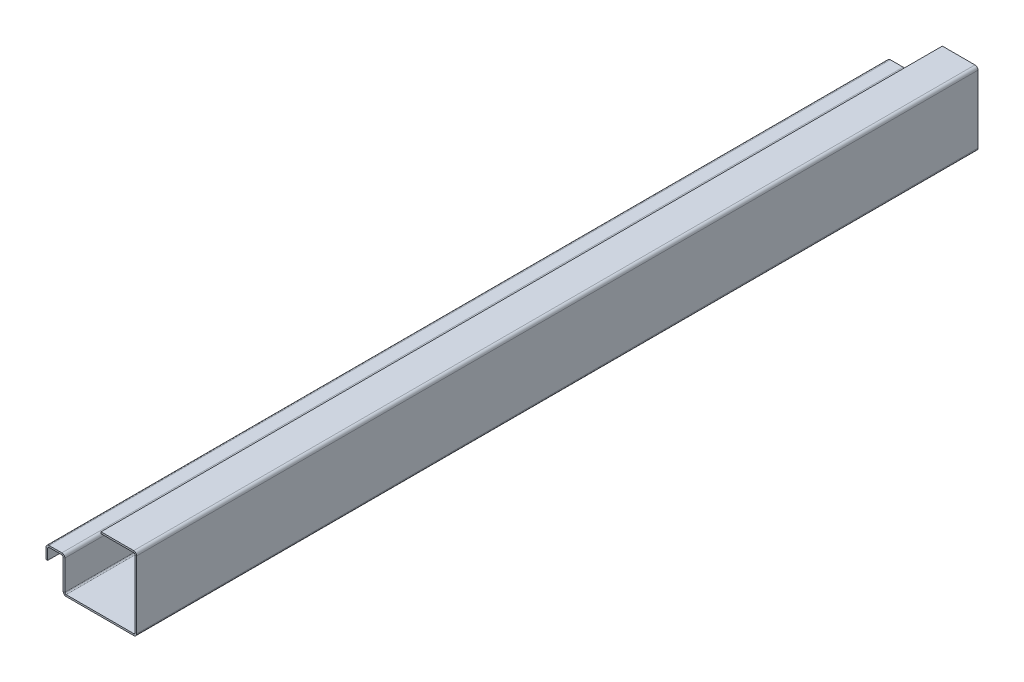
ISO-10303-21;
HEADER;
FILE_DESCRIPTION(('STEP AP214'),'2;1');
FILE_NAME('part.step','',(''),(''),'','','');
FILE_SCHEMA(('AUTOMOTIVE_DESIGN { 1 0 10303 214 1 1 1 1 }'));
ENDSEC;
DATA;
#1=APPLICATION_CONTEXT('core data for automotive mechanical design processes');
#2=APPLICATION_PROTOCOL_DEFINITION('international standard','automotive_design',2000,#1);
#3=PRODUCT_CONTEXT('',#1,'mechanical');
#4=PRODUCT('Part','Part','',(#3));
#5=PRODUCT_RELATED_PRODUCT_CATEGORY('part','',(#4));
#6=PRODUCT_DEFINITION_FORMATION('','',#4);
#7=PRODUCT_DEFINITION_CONTEXT('part definition',#1,'design');
#8=PRODUCT_DEFINITION('design','',#6,#7);
#9=PRODUCT_DEFINITION_SHAPE('','',#8);
#10=(LENGTH_UNIT() NAMED_UNIT(*) SI_UNIT(.MILLI.,.METRE.));
#11=(NAMED_UNIT(*) PLANE_ANGLE_UNIT() SI_UNIT($,.RADIAN.));
#12=(NAMED_UNIT(*) SI_UNIT($,.STERADIAN.) SOLID_ANGLE_UNIT());
#13=UNCERTAINTY_MEASURE_WITH_UNIT(LENGTH_MEASURE(1.E-05),#10,'distance_accuracy_value','');
#14=(GEOMETRIC_REPRESENTATION_CONTEXT(3) GLOBAL_UNCERTAINTY_ASSIGNED_CONTEXT((#13)) GLOBAL_UNIT_ASSIGNED_CONTEXT((#10,
#11,#12)) REPRESENTATION_CONTEXT('',''));
#15=CARTESIAN_POINT('',(0.,0.,0.));
#16=DIRECTION('',(0.,0.,1.));
#17=DIRECTION('',(1.,0.,0.));
#18=AXIS2_PLACEMENT_3D('',#15,#16,#17);
#19=CARTESIAN_POINT('',(-60.5,40.4,500.));
#20=DIRECTION('',(0.,0.,1.));
#21=DIRECTION('',(1.,0.,0.));
#22=AXIS2_PLACEMENT_3D('',#19,#20,#21);
#23=PLANE('',#22);
#24=DIRECTION('',(0.,-1.,0.));
#25=VECTOR('',#24,1.);
#26=CARTESIAN_POINT('',(-60.5,40.4,500.));
#27=LINE('',#26,#25);
#28=CARTESIAN_POINT('',(-60.5,40.4,500.));
#29=VERTEX_POINT('',#28);
#30=CARTESIAN_POINT('',(-60.5,38.4,500.));
#31=VERTEX_POINT('',#30);
#32=EDGE_CURVE('E11',#29,#31,#27,.T.);
#33=ORIENTED_EDGE('',*,*,#32,.F.);
#34=CARTESIAN_POINT('',(-60.5,36.8,500.));
#35=DIRECTION('',(0.,0.,1.));
#36=DIRECTION('',(1.,0.,0.));
#37=AXIS2_PLACEMENT_3D('',#34,#35,#36);
#38=CIRCLE('',#37,3.6);
#39=CARTESIAN_POINT('',(-64.1,36.8,500.));
#40=VERTEX_POINT('',#39);
#41=EDGE_CURVE('E422',#40,#29,#38,.F.);
#42=ORIENTED_EDGE('',*,*,#41,.F.);
#43=DIRECTION('',(-1.,0.,0.));
#44=VECTOR('',#43,1.);
#45=CARTESIAN_POINT('',(-62.1,36.8,500.));
#46=LINE('',#45,#44);
#47=CARTESIAN_POINT('',(-62.1,36.8,500.));
#48=VERTEX_POINT('',#47);
#49=EDGE_CURVE('E45',#48,#40,#46,.T.);
#50=ORIENTED_EDGE('',*,*,#49,.F.);
#51=CARTESIAN_POINT('',(-60.5,36.8,500.));
#52=DIRECTION('',(0.,0.,1.));
#53=DIRECTION('',(1.,0.,0.));
#54=AXIS2_PLACEMENT_3D('',#51,#52,#53);
#55=CIRCLE('',#54,1.6);
#56=EDGE_CURVE('E435',#48,#31,#55,.F.);
#57=ORIENTED_EDGE('',*,*,#56,.T.);
#58=EDGE_LOOP('',(#33,#42,#50,#57));
#59=FACE_BOUND('',#58,.T.);
#60=ADVANCED_FACE('F37',(#59),#23,.T.);
#61=CARTESIAN_POINT('',(-62.1,36.8,500.));
#62=DIRECTION('',(0.,0.,1.));
#63=DIRECTION('',(1.,0.,0.));
#64=AXIS2_PLACEMENT_3D('',#61,#62,#63);
#65=PLANE('',#64);
#66=DIRECTION('',(1.,0.,0.));
#67=VECTOR('',#66,1.);
#68=CARTESIAN_POINT('',(-64.1,40.4,500.));
#69=LINE('',#68,#67);
#70=CARTESIAN_POINT('',(-45.3,40.4,500.));
#71=VERTEX_POINT('',#70);
#72=EDGE_CURVE('E426',#29,#71,#69,.T.);
#73=ORIENTED_EDGE('',*,*,#72,.F.);
#74=ORIENTED_EDGE('',*,*,#32,.T.);
#75=DIRECTION('',(1.,0.,0.));
#76=VECTOR('',#75,1.);
#77=CARTESIAN_POINT('',(-64.1,38.4,500.));
#78=LINE('',#77,#76);
#79=CARTESIAN_POINT('',(-45.3,38.4,500.));
#80=VERTEX_POINT('',#79);
#81=EDGE_CURVE('E437',#31,#80,#78,.T.);
#82=ORIENTED_EDGE('',*,*,#81,.T.);
#83=DIRECTION('',(0.,1.,0.));
#84=VECTOR('',#83,1.);
#85=CARTESIAN_POINT('',(-45.3,38.4,500.));
#86=LINE('',#85,#84);
#87=EDGE_CURVE('E396',#80,#71,#86,.T.);
#88=ORIENTED_EDGE('',*,*,#87,.T.);
#89=EDGE_LOOP('',(#73,#74,#82,#88));
#90=FACE_BOUND('',#89,.T.);
#91=ADVANCED_FACE('F518',(#90),#65,.T.);
#92=CARTESIAN_POINT('',(-64.1,36.8,-500.));
#93=DIRECTION('',(0.,0.,-1.));
#94=DIRECTION('',(-1.,0.,0.));
#95=AXIS2_PLACEMENT_3D('',#92,#93,#94);
#96=PLANE('',#95);
#97=DIRECTION('',(1.,0.,0.));
#98=VECTOR('',#97,1.);
#99=CARTESIAN_POINT('',(-64.1,36.8,-500.));
#100=LINE('',#99,#98);
#101=CARTESIAN_POINT('',(-64.1,36.8,-500.));
#102=VERTEX_POINT('',#101);
#103=CARTESIAN_POINT('',(-62.1,36.8,-500.));
#104=VERTEX_POINT('',#103);
#105=EDGE_CURVE('E402',#102,#104,#100,.T.);
#106=ORIENTED_EDGE('',*,*,#105,.F.);
#107=CARTESIAN_POINT('',(-60.5,36.8,-500.));
#108=DIRECTION('',(0.,0.,1.));
#109=DIRECTION('',(1.,0.,0.));
#110=AXIS2_PLACEMENT_3D('',#107,#108,#109);
#111=CIRCLE('',#110,3.6);
#112=CARTESIAN_POINT('',(-60.5,40.4,-500.));
#113=VERTEX_POINT('',#112);
#114=EDGE_CURVE('E280',#102,#113,#111,.F.);
#115=ORIENTED_EDGE('',*,*,#114,.T.);
#116=DIRECTION('',(0.,1.,0.));
#117=VECTOR('',#116,1.);
#118=CARTESIAN_POINT('',(-60.5,38.4,-500.));
#119=LINE('',#118,#117);
#120=CARTESIAN_POINT('',(-60.5,38.4,-500.));
#121=VERTEX_POINT('',#120);
#122=EDGE_CURVE('E400',#121,#113,#119,.T.);
#123=ORIENTED_EDGE('',*,*,#122,.F.);
#124=CARTESIAN_POINT('',(-60.5,36.8,-500.));
#125=DIRECTION('',(0.,0.,1.));
#126=DIRECTION('',(1.,0.,0.));
#127=AXIS2_PLACEMENT_3D('',#124,#125,#126);
#128=CIRCLE('',#127,1.6);
#129=EDGE_CURVE('E292',#104,#121,#128,.F.);
#130=ORIENTED_EDGE('',*,*,#129,.F.);
#131=EDGE_LOOP('',(#106,#115,#123,#130));
#132=FACE_BOUND('',#131,.T.);
#133=ADVANCED_FACE('F577',(#132),#96,.T.);
#134=CARTESIAN_POINT('',(-60.5,38.4,-500.));
#135=DIRECTION('',(0.,0.,-1.));
#136=DIRECTION('',(-1.,0.,0.));
#137=AXIS2_PLACEMENT_3D('',#134,#135,#136);
#138=PLANE('',#137);
#139=DIRECTION('',(0.,1.,0.));
#140=VECTOR('',#139,1.);
#141=CARTESIAN_POINT('',(-64.1,24.2,-500.));
#142=LINE('',#141,#140);
#143=CARTESIAN_POINT('',(-64.1,24.2,-500.));
#144=VERTEX_POINT('',#143);
#145=EDGE_CURVE('E283',#144,#102,#142,.T.);
#146=ORIENTED_EDGE('',*,*,#145,.T.);
#147=ORIENTED_EDGE('',*,*,#105,.T.);
#148=DIRECTION('',(0.,1.,0.));
#149=VECTOR('',#148,1.);
#150=CARTESIAN_POINT('',(-62.1,24.2,-500.));
#151=LINE('',#150,#149);
#152=CARTESIAN_POINT('',(-62.1,24.2,-500.));
#153=VERTEX_POINT('',#152);
#154=EDGE_CURVE('E289',#153,#104,#151,.T.);
#155=ORIENTED_EDGE('',*,*,#154,.F.);
#156=DIRECTION('',(-1.,0.,0.));
#157=VECTOR('',#156,1.);
#158=CARTESIAN_POINT('',(-62.1,24.2,-500.));
#159=LINE('',#158,#157);
#160=EDGE_CURVE('E286',#153,#144,#159,.T.);
#161=ORIENTED_EDGE('',*,*,#160,.T.);
#162=EDGE_LOOP('',(#146,#147,#155,#161));
#163=FACE_BOUND('',#162,.T.);
#164=ADVANCED_FACE('F581',(#163),#138,.T.);
#165=CARTESIAN_POINT('',(-41.7,36.8,500.));
#166=DIRECTION('',(0.,0.,1.));
#167=DIRECTION('',(1.,0.,0.));
#168=AXIS2_PLACEMENT_3D('',#165,#166,#167);
#169=PLANE('',#168);
#170=DIRECTION('',(-1.,0.,0.));
#171=VECTOR('',#170,1.);
#172=CARTESIAN_POINT('',(-41.7,36.8,500.));
#173=LINE('',#172,#171);
#174=CARTESIAN_POINT('',(-41.7,36.8,500.));
#175=VERTEX_POINT('',#174);
#176=CARTESIAN_POINT('',(-43.7,36.8,500.));
#177=VERTEX_POINT('',#176);
#178=EDGE_CURVE('E398',#175,#177,#173,.T.);
#179=ORIENTED_EDGE('',*,*,#178,.F.);
#180=CARTESIAN_POINT('',(-45.3,36.8,500.));
#181=DIRECTION('',(0.,0.,1.));
#182=DIRECTION('',(1.,0.,0.));
#183=AXIS2_PLACEMENT_3D('',#180,#181,#182);
#184=CIRCLE('',#183,3.6);
#185=EDGE_CURVE('E508',#71,#175,#184,.F.);
#186=ORIENTED_EDGE('',*,*,#185,.F.);
#187=ORIENTED_EDGE('',*,*,#87,.F.);
#188=CARTESIAN_POINT('',(-45.3,36.8,500.));
#189=DIRECTION('',(0.,0.,1.));
#190=DIRECTION('',(1.,0.,0.));
#191=AXIS2_PLACEMENT_3D('',#188,#189,#190);
#192=CIRCLE('',#191,1.6);
#193=EDGE_CURVE('E440',#80,#177,#192,.F.);
#194=ORIENTED_EDGE('',*,*,#193,.T.);
#195=EDGE_LOOP('',(#179,#186,#187,#194));
#196=FACE_BOUND('',#195,.T.);
#197=ADVANCED_FACE('F525',(#196),#169,.T.);
#198=CARTESIAN_POINT('',(-45.3,38.4,500.));
#199=DIRECTION('',(0.,0.,1.));
#200=DIRECTION('',(1.,0.,0.));
#201=AXIS2_PLACEMENT_3D('',#198,#199,#200);
#202=PLANE('',#201);
#203=DIRECTION('',(0.,-1.,0.));
#204=VECTOR('',#203,1.);
#205=CARTESIAN_POINT('',(-41.7,40.4,500.));
#206=LINE('',#205,#204);
#207=CARTESIAN_POINT('',(-41.7,1.6,500.));
#208=VERTEX_POINT('',#207);
#209=EDGE_CURVE('E505',#175,#208,#206,.T.);
#210=ORIENTED_EDGE('',*,*,#209,.F.);
#211=ORIENTED_EDGE('',*,*,#178,.T.);
#212=DIRECTION('',(0.,1.,0.));
#213=VECTOR('',#212,1.);
#214=CARTESIAN_POINT('',(-43.7,40.4,500.));
#215=LINE('',#214,#213);
#216=CARTESIAN_POINT('',(-43.7,1.6,500.));
#217=VERTEX_POINT('',#216);
#218=EDGE_CURVE('E443',#177,#217,#215,.F.);
#219=ORIENTED_EDGE('',*,*,#218,.T.);
#220=DIRECTION('',(1.,0.,0.));
#221=VECTOR('',#220,1.);
#222=CARTESIAN_POINT('',(-43.7,1.6,500.));
#223=LINE('',#222,#221);
#224=EDGE_CURVE('E388',#217,#208,#223,.T.);
#225=ORIENTED_EDGE('',*,*,#224,.T.);
#226=EDGE_LOOP('',(#210,#211,#219,#225));
#227=FACE_BOUND('',#226,.T.);
#228=ADVANCED_FACE('F534',(#227),#202,.T.);
#229=CARTESIAN_POINT('',(-45.3,40.4,-500.));
#230=DIRECTION('',(0.,0.,-1.));
#231=DIRECTION('',(-1.,0.,0.));
#232=AXIS2_PLACEMENT_3D('',#229,#230,#231);
#233=PLANE('',#232);
#234=DIRECTION('',(0.,-1.,0.));
#235=VECTOR('',#234,1.);
#236=CARTESIAN_POINT('',(-45.3,40.4,-500.));
#237=LINE('',#236,#235);
#238=CARTESIAN_POINT('',(-45.3,40.4,-500.));
#239=VERTEX_POINT('',#238);
#240=CARTESIAN_POINT('',(-45.3,38.4,-500.));
#241=VERTEX_POINT('',#240);
#242=EDGE_CURVE('E394',#239,#241,#237,.T.);
#243=ORIENTED_EDGE('',*,*,#242,.F.);
#244=CARTESIAN_POINT('',(-45.3,36.8,-500.));
#245=DIRECTION('',(0.,0.,1.));
#246=DIRECTION('',(1.,0.,0.));
#247=AXIS2_PLACEMENT_3D('',#244,#245,#246);
#248=CIRCLE('',#247,3.6);
#249=CARTESIAN_POINT('',(-41.7,36.8,-500.));
#250=VERTEX_POINT('',#249);
#251=EDGE_CURVE('E274',#239,#250,#248,.F.);
#252=ORIENTED_EDGE('',*,*,#251,.T.);
#253=DIRECTION('',(1.,0.,0.));
#254=VECTOR('',#253,1.);
#255=CARTESIAN_POINT('',(-43.7,36.8,-500.));
#256=LINE('',#255,#254);
#257=CARTESIAN_POINT('',(-43.7,36.8,-500.));
#258=VERTEX_POINT('',#257);
#259=EDGE_CURVE('E392',#258,#250,#256,.T.);
#260=ORIENTED_EDGE('',*,*,#259,.F.);
#261=CARTESIAN_POINT('',(-45.3,36.8,-500.));
#262=DIRECTION('',(0.,0.,1.));
#263=DIRECTION('',(1.,0.,0.));
#264=AXIS2_PLACEMENT_3D('',#261,#262,#263);
#265=CIRCLE('',#264,1.6);
#266=EDGE_CURVE('E298',#241,#258,#265,.F.);
#267=ORIENTED_EDGE('',*,*,#266,.F.);
#268=EDGE_LOOP('',(#243,#252,#260,#267));
#269=FACE_BOUND('',#268,.T.);
#270=ADVANCED_FACE('F592',(#269),#233,.T.);
#271=CARTESIAN_POINT('',(-43.7,36.8,-500.));
#272=DIRECTION('',(0.,0.,-1.));
#273=DIRECTION('',(-1.,0.,0.));
#274=AXIS2_PLACEMENT_3D('',#271,#272,#273);
#275=PLANE('',#274);
#276=DIRECTION('',(1.,0.,0.));
#277=VECTOR('',#276,1.);
#278=CARTESIAN_POINT('',(-64.1,40.4,-500.));
#279=LINE('',#278,#277);
#280=EDGE_CURVE('E277',#113,#239,#279,.T.);
#281=ORIENTED_EDGE('',*,*,#280,.T.);
#282=ORIENTED_EDGE('',*,*,#242,.T.);
#283=DIRECTION('',(1.,0.,0.));
#284=VECTOR('',#283,1.);
#285=CARTESIAN_POINT('',(-64.1,38.4,-500.));
#286=LINE('',#285,#284);
#287=EDGE_CURVE('E295',#121,#241,#286,.T.);
#288=ORIENTED_EDGE('',*,*,#287,.F.);
#289=ORIENTED_EDGE('',*,*,#122,.T.);
#290=EDGE_LOOP('',(#281,#282,#288,#289));
#291=FACE_BOUND('',#290,.T.);
#292=ADVANCED_FACE('F595',(#291),#275,.T.);
#293=CARTESIAN_POINT('',(-40.1,0.,500.));
#294=DIRECTION('',(0.,0.,1.));
#295=DIRECTION('',(1.,0.,0.));
#296=AXIS2_PLACEMENT_3D('',#293,#294,#295);
#297=PLANE('',#296);
#298=DIRECTION('',(0.,-1.,0.));
#299=VECTOR('',#298,1.);
#300=CARTESIAN_POINT('',(-40.1,0.,500.));
#301=LINE('',#300,#299);
#302=CARTESIAN_POINT('',(-40.1,0.,500.));
#303=VERTEX_POINT('',#302);
#304=CARTESIAN_POINT('',(-40.1,-2.,500.));
#305=VERTEX_POINT('',#304);
#306=EDGE_CURVE('E390',#303,#305,#301,.T.);
#307=ORIENTED_EDGE('',*,*,#306,.F.);
#308=CARTESIAN_POINT('',(-40.1,1.6,500.));
#309=DIRECTION('',(0.,0.,-1.));
#310=DIRECTION('',(-1.,0.,0.));
#311=AXIS2_PLACEMENT_3D('',#308,#309,#310);
#312=CIRCLE('',#311,1.6);
#313=EDGE_CURVE('E502',#208,#303,#312,.F.);
#314=ORIENTED_EDGE('',*,*,#313,.F.);
#315=ORIENTED_EDGE('',*,*,#224,.F.);
#316=CARTESIAN_POINT('',(-40.1,1.6,500.));
#317=DIRECTION('',(0.,0.,1.));
#318=DIRECTION('',(1.,0.,0.));
#319=AXIS2_PLACEMENT_3D('',#316,#317,#318);
#320=CIRCLE('',#319,3.6);
#321=EDGE_CURVE('E446',#217,#305,#320,.T.);
#322=ORIENTED_EDGE('',*,*,#321,.T.);
#323=EDGE_LOOP('',(#307,#314,#315,#322));
#324=FACE_BOUND('',#323,.T.);
#325=ADVANCED_FACE('F543',(#324),#297,.T.);
#326=CARTESIAN_POINT('',(-43.7,1.6,500.));
#327=DIRECTION('',(0.,0.,1.));
#328=DIRECTION('',(1.,0.,0.));
#329=AXIS2_PLACEMENT_3D('',#326,#327,#328);
#330=PLANE('',#329);
#331=DIRECTION('',(1.,0.,0.));
#332=VECTOR('',#331,1.);
#333=CARTESIAN_POINT('',(-41.7,0.,500.));
#334=LINE('',#333,#332);
#335=CARTESIAN_POINT('',(40.1,0.,500.));
#336=VERTEX_POINT('',#335);
#337=EDGE_CURVE('E499',#303,#336,#334,.T.);
#338=ORIENTED_EDGE('',*,*,#337,.F.);
#339=ORIENTED_EDGE('',*,*,#306,.T.);
#340=DIRECTION('',(1.,0.,0.));
#341=VECTOR('',#340,1.);
#342=CARTESIAN_POINT('',(-41.7,-2.,500.));
#343=LINE('',#342,#341);
#344=CARTESIAN_POINT('',(40.1,-1.99999999999998,500.));
#345=VERTEX_POINT('',#344);
#346=EDGE_CURVE('E228',#305,#345,#343,.T.);
#347=ORIENTED_EDGE('',*,*,#346,.T.);
#348=DIRECTION('',(0.,1.,0.));
#349=VECTOR('',#348,1.);
#350=CARTESIAN_POINT('',(40.1,-1.99999999999998,500.));
#351=LINE('',#350,#349);
#352=EDGE_CURVE('E219',#345,#336,#351,.T.);
#353=ORIENTED_EDGE('',*,*,#352,.T.);
#354=EDGE_LOOP('',(#338,#339,#347,#353));
#355=FACE_BOUND('',#354,.T.);
#356=ADVANCED_FACE('F452',(#355),#330,.T.);
#357=CARTESIAN_POINT('',(-41.7,1.6,-500.));
#358=DIRECTION('',(0.,0.,-1.));
#359=DIRECTION('',(-1.,0.,0.));
#360=AXIS2_PLACEMENT_3D('',#357,#358,#359);
#361=PLANE('',#360);
#362=DIRECTION('',(-1.,0.,0.));
#363=VECTOR('',#362,1.);
#364=CARTESIAN_POINT('',(-41.7,1.6,-500.));
#365=LINE('',#364,#363);
#366=CARTESIAN_POINT('',(-41.7,1.6,-500.));
#367=VERTEX_POINT('',#366);
#368=CARTESIAN_POINT('',(-43.7,1.6,-500.));
#369=VERTEX_POINT('',#368);
#370=EDGE_CURVE('E386',#367,#369,#365,.T.);
#371=ORIENTED_EDGE('',*,*,#370,.F.);
#372=CARTESIAN_POINT('',(-40.1,1.6,-500.));
#373=DIRECTION('',(0.,0.,-1.));
#374=DIRECTION('',(-1.,0.,0.));
#375=AXIS2_PLACEMENT_3D('',#372,#373,#374);
#376=CIRCLE('',#375,1.6);
#377=CARTESIAN_POINT('',(-40.1,0.,-500.));
#378=VERTEX_POINT('',#377);
#379=EDGE_CURVE('E268',#367,#378,#376,.F.);
#380=ORIENTED_EDGE('',*,*,#379,.T.);
#381=DIRECTION('',(0.,1.,0.));
#382=VECTOR('',#381,1.);
#383=CARTESIAN_POINT('',(-40.1,-2.,-500.));
#384=LINE('',#383,#382);
#385=CARTESIAN_POINT('',(-40.1,-2.,-500.));
#386=VERTEX_POINT('',#385);
#387=EDGE_CURVE('E218',#386,#378,#384,.T.);
#388=ORIENTED_EDGE('',*,*,#387,.F.);
#389=CARTESIAN_POINT('',(-40.1,1.6,-500.));
#390=DIRECTION('',(0.,0.,1.));
#391=DIRECTION('',(1.,0.,0.));
#392=AXIS2_PLACEMENT_3D('',#389,#390,#391);
#393=CIRCLE('',#392,3.6);
#394=EDGE_CURVE('E304',#369,#386,#393,.T.);
#395=ORIENTED_EDGE('',*,*,#394,.F.);
#396=EDGE_LOOP('',(#371,#380,#388,#395));
#397=FACE_BOUND('',#396,.T.);
#398=ADVANCED_FACE('F552',(#397),#361,.T.);
#399=CARTESIAN_POINT('',(-40.1,-2.,-500.));
#400=DIRECTION('',(0.,0.,-1.));
#401=DIRECTION('',(-1.,0.,0.));
#402=AXIS2_PLACEMENT_3D('',#399,#400,#401);
#403=PLANE('',#402);
#404=DIRECTION('',(0.,-1.,0.));
#405=VECTOR('',#404,1.);
#406=CARTESIAN_POINT('',(-41.7,40.4,-500.));
#407=LINE('',#406,#405);
#408=EDGE_CURVE('E271',#250,#367,#407,.T.);
#409=ORIENTED_EDGE('',*,*,#408,.T.);
#410=ORIENTED_EDGE('',*,*,#370,.T.);
#411=DIRECTION('',(0.,1.,0.));
#412=VECTOR('',#411,1.);
#413=CARTESIAN_POINT('',(-43.7,40.4,-500.));
#414=LINE('',#413,#412);
#415=EDGE_CURVE('E301',#258,#369,#414,.F.);
#416=ORIENTED_EDGE('',*,*,#415,.F.);
#417=ORIENTED_EDGE('',*,*,#259,.T.);
#418=EDGE_LOOP('',(#409,#410,#416,#417));
#419=FACE_BOUND('',#418,.T.);
#420=ADVANCED_FACE('F556',(#419),#403,.T.);
#421=CARTESIAN_POINT('',(41.7,1.60000000000001,500.));
#422=DIRECTION('',(0.,0.,1.));
#423=DIRECTION('',(1.,0.,0.));
#424=AXIS2_PLACEMENT_3D('',#421,#422,#423);
#425=PLANE('',#424);
#426=DIRECTION('',(1.,0.,0.));
#427=VECTOR('',#426,1.);
#428=CARTESIAN_POINT('',(41.7,1.60000000000001,500.));
#429=LINE('',#428,#427);
#430=CARTESIAN_POINT('',(41.7,1.60000000000001,500.));
#431=VERTEX_POINT('',#430);
#432=CARTESIAN_POINT('',(43.7,1.60000000000001,500.));
#433=VERTEX_POINT('',#432);
#434=EDGE_CURVE('E206',#431,#433,#429,.T.);
#435=ORIENTED_EDGE('',*,*,#434,.F.);
#436=CARTESIAN_POINT('',(40.1,1.60000000000001,500.));
#437=DIRECTION('',(0.,0.,-1.));
#438=DIRECTION('',(-1.,0.,0.));
#439=AXIS2_PLACEMENT_3D('',#436,#437,#438);
#440=CIRCLE('',#439,1.6);
#441=EDGE_CURVE('E464',#336,#431,#440,.F.);
#442=ORIENTED_EDGE('',*,*,#441,.F.);
#443=ORIENTED_EDGE('',*,*,#352,.F.);
#444=CARTESIAN_POINT('',(40.1,1.60000000000001,500.));
#445=DIRECTION('',(0.,0.,1.));
#446=DIRECTION('',(1.,0.,0.));
#447=AXIS2_PLACEMENT_3D('',#444,#445,#446);
#448=CIRCLE('',#447,3.6);
#449=EDGE_CURVE('E222',#345,#433,#448,.T.);
#450=ORIENTED_EDGE('',*,*,#449,.T.);
#451=EDGE_LOOP('',(#435,#442,#443,#450));
#452=FACE_BOUND('',#451,.T.);
#453=ADVANCED_FACE('F224',(#452),#425,.T.);
#454=CARTESIAN_POINT('',(40.1,-1.99999999999998,500.));
#455=DIRECTION('',(0.,0.,1.));
#456=DIRECTION('',(1.,0.,0.));
#457=AXIS2_PLACEMENT_3D('',#454,#455,#456);
#458=PLANE('',#457);
#459=DIRECTION('',(0.,1.,0.));
#460=VECTOR('',#459,1.);
#461=CARTESIAN_POINT('',(41.7,0.,500.));
#462=LINE('',#461,#460);
#463=CARTESIAN_POINT('',(41.7,81.8,500.));
#464=VERTEX_POINT('',#463);
#465=EDGE_CURVE('E213',#431,#464,#462,.T.);
#466=ORIENTED_EDGE('',*,*,#465,.F.);
#467=ORIENTED_EDGE('',*,*,#434,.T.);
#468=DIRECTION('',(0.,1.,0.));
#469=VECTOR('',#468,1.);
#470=CARTESIAN_POINT('',(43.7,0.,500.));
#471=LINE('',#470,#469);
#472=CARTESIAN_POINT('',(43.7,81.8,500.));
#473=VERTEX_POINT('',#472);
#474=EDGE_CURVE('E210',#433,#473,#471,.T.);
#475=ORIENTED_EDGE('',*,*,#474,.T.);
#476=DIRECTION('',(-1.,0.,0.));
#477=VECTOR('',#476,1.);
#478=CARTESIAN_POINT('',(43.7,81.8,500.));
#479=LINE('',#478,#477);
#480=EDGE_CURVE('E377',#473,#464,#479,.T.);
#481=ORIENTED_EDGE('',*,*,#480,.T.);
#482=EDGE_LOOP('',(#466,#467,#475,#481));
#483=FACE_BOUND('',#482,.T.);
#484=ADVANCED_FACE('F208',(#483),#458,.T.);
#485=CARTESIAN_POINT('',(40.1,0.,-500.));
#486=DIRECTION('',(0.,0.,-1.));
#487=DIRECTION('',(-1.,0.,0.));
#488=AXIS2_PLACEMENT_3D('',#485,#486,#487);
#489=PLANE('',#488);
#490=DIRECTION('',(0.,-1.,0.));
#491=VECTOR('',#490,1.);
#492=CARTESIAN_POINT('',(40.1,0.,-500.));
#493=LINE('',#492,#491);
#494=CARTESIAN_POINT('',(40.1,0.,-500.));
#495=VERTEX_POINT('',#494);
#496=CARTESIAN_POINT('',(40.1,-1.99999999999998,-500.));
#497=VERTEX_POINT('',#496);
#498=EDGE_CURVE('E382',#495,#497,#493,.T.);
#499=ORIENTED_EDGE('',*,*,#498,.F.);
#500=CARTESIAN_POINT('',(40.1,1.60000000000001,-500.));
#501=DIRECTION('',(0.,0.,-1.));
#502=DIRECTION('',(-1.,0.,0.));
#503=AXIS2_PLACEMENT_3D('',#500,#501,#502);
#504=CIRCLE('',#503,1.6);
#505=CARTESIAN_POINT('',(41.7,1.60000000000001,-500.));
#506=VERTEX_POINT('',#505);
#507=EDGE_CURVE('E262',#495,#506,#504,.F.);
#508=ORIENTED_EDGE('',*,*,#507,.T.);
#509=DIRECTION('',(-1.,0.,0.));
#510=VECTOR('',#509,1.);
#511=CARTESIAN_POINT('',(43.7,1.60000000000001,-500.));
#512=LINE('',#511,#510);
#513=CARTESIAN_POINT('',(43.7,1.60000000000001,-500.));
#514=VERTEX_POINT('',#513);
#515=EDGE_CURVE('E380',#514,#506,#512,.T.);
#516=ORIENTED_EDGE('',*,*,#515,.F.);
#517=CARTESIAN_POINT('',(40.1,1.60000000000001,-500.));
#518=DIRECTION('',(0.,0.,1.));
#519=DIRECTION('',(1.,0.,0.));
#520=AXIS2_PLACEMENT_3D('',#517,#518,#519);
#521=CIRCLE('',#520,3.6);
#522=EDGE_CURVE('E235',#497,#514,#521,.T.);
#523=ORIENTED_EDGE('',*,*,#522,.F.);
#524=EDGE_LOOP('',(#499,#508,#516,#523));
#525=FACE_BOUND('',#524,.T.);
#526=ADVANCED_FACE('F458',(#525),#489,.T.);
#527=CARTESIAN_POINT('',(43.7,1.60000000000001,-500.));
#528=DIRECTION('',(0.,0.,-1.));
#529=DIRECTION('',(-1.,0.,0.));
#530=AXIS2_PLACEMENT_3D('',#527,#528,#529);
#531=PLANE('',#530);
#532=DIRECTION('',(1.,0.,0.));
#533=VECTOR('',#532,1.);
#534=CARTESIAN_POINT('',(-41.7,0.,-500.));
#535=LINE('',#534,#533);
#536=EDGE_CURVE('E265',#378,#495,#535,.T.);
#537=ORIENTED_EDGE('',*,*,#536,.T.);
#538=ORIENTED_EDGE('',*,*,#498,.T.);
#539=DIRECTION('',(1.,0.,0.));
#540=VECTOR('',#539,1.);
#541=CARTESIAN_POINT('',(-41.7,-2.,-500.));
#542=LINE('',#541,#540);
#543=EDGE_CURVE('E307',#386,#497,#542,.T.);
#544=ORIENTED_EDGE('',*,*,#543,.F.);
#545=ORIENTED_EDGE('',*,*,#387,.T.);
#546=EDGE_LOOP('',(#537,#538,#544,#545));
#547=FACE_BOUND('',#546,.T.);
#548=ADVANCED_FACE('F561',(#547),#531,.T.);
#549=CARTESIAN_POINT('',(40.1,83.4,500.));
#550=DIRECTION('',(0.,0.,1.));
#551=DIRECTION('',(1.,0.,0.));
#552=AXIS2_PLACEMENT_3D('',#549,#550,#551);
#553=PLANE('',#552);
#554=DIRECTION('',(0.,1.,0.));
#555=VECTOR('',#554,1.);
#556=CARTESIAN_POINT('',(40.1,83.4,500.));
#557=LINE('',#556,#555);
#558=CARTESIAN_POINT('',(40.1,83.4,500.));
#559=VERTEX_POINT('',#558);
#560=CARTESIAN_POINT('',(40.1,85.4,500.));
#561=VERTEX_POINT('',#560);
#562=EDGE_CURVE('E53',#559,#561,#557,.T.);
#563=ORIENTED_EDGE('',*,*,#562,.F.);
#564=CARTESIAN_POINT('',(40.1,81.8,500.));
#565=DIRECTION('',(0.,0.,-1.));
#566=DIRECTION('',(-1.,0.,0.));
#567=AXIS2_PLACEMENT_3D('',#564,#565,#566);
#568=CIRCLE('',#567,1.6);
#569=EDGE_CURVE('E492',#464,#559,#568,.F.);
#570=ORIENTED_EDGE('',*,*,#569,.F.);
#571=ORIENTED_EDGE('',*,*,#480,.F.);
#572=CARTESIAN_POINT('',(40.1,81.8,500.));
#573=DIRECTION('',(0.,0.,1.));
#574=DIRECTION('',(1.,0.,0.));
#575=AXIS2_PLACEMENT_3D('',#572,#573,#574);
#576=CIRCLE('',#575,3.6);
#577=EDGE_CURVE('E243',#473,#561,#576,.T.);
#578=ORIENTED_EDGE('',*,*,#577,.T.);
#579=EDGE_LOOP('',(#563,#570,#571,#578));
#580=FACE_BOUND('',#579,.T.);
#581=ADVANCED_FACE('F563',(#580),#553,.T.);
#582=CARTESIAN_POINT('',(43.7,81.8,500.));
#583=DIRECTION('',(0.,0.,1.));
#584=DIRECTION('',(1.,0.,0.));
#585=AXIS2_PLACEMENT_3D('',#582,#583,#584);
#586=PLANE('',#585);
#587=DIRECTION('',(-1.,0.,0.));
#588=VECTOR('',#587,1.);
#589=CARTESIAN_POINT('',(41.7,83.4,500.));
#590=LINE('',#589,#588);
#591=CARTESIAN_POINT('',(1.3,83.4,500.));
#592=VERTEX_POINT('',#591);
#593=EDGE_CURVE('E490',#559,#592,#590,.T.);
#594=ORIENTED_EDGE('',*,*,#593,.F.);
#595=ORIENTED_EDGE('',*,*,#562,.T.);
#596=DIRECTION('',(-1.,0.,0.));
#597=VECTOR('',#596,1.);
#598=CARTESIAN_POINT('',(41.7,85.4,500.));
#599=LINE('',#598,#597);
#600=CARTESIAN_POINT('',(1.3,85.4,500.));
#601=VERTEX_POINT('',#600);
#602=EDGE_CURVE('E143',#561,#601,#599,.T.);
#603=ORIENTED_EDGE('',*,*,#602,.T.);
#604=DIRECTION('',(0.,1.,0.));
#605=VECTOR('',#604,1.);
#606=CARTESIAN_POINT('',(1.3,83.4,500.));
#607=LINE('',#606,#605);
#608=EDGE_CURVE('E488',#592,#601,#607,.T.);
#609=ORIENTED_EDGE('',*,*,#608,.F.);
#610=EDGE_LOOP('',(#594,#595,#603,#609));
#611=FACE_BOUND('',#610,.T.);
#612=ADVANCED_FACE('F569',(#611),#586,.T.);
#613=CARTESIAN_POINT('',(41.7,81.8,-500.));
#614=DIRECTION('',(0.,0.,-1.));
#615=DIRECTION('',(-1.,0.,0.));
#616=AXIS2_PLACEMENT_3D('',#613,#614,#615);
#617=PLANE('',#616);
#618=DIRECTION('',(1.,0.,0.));
#619=VECTOR('',#618,1.);
#620=CARTESIAN_POINT('',(41.7,81.8,-500.));
#621=LINE('',#620,#619);
#622=CARTESIAN_POINT('',(41.7,81.8,-500.));
#623=VERTEX_POINT('',#622);
#624=CARTESIAN_POINT('',(43.7,81.8,-500.));
#625=VERTEX_POINT('',#624);
#626=EDGE_CURVE('E130',#623,#625,#621,.T.);
#627=ORIENTED_EDGE('',*,*,#626,.F.);
#628=CARTESIAN_POINT('',(40.1,81.8,-500.));
#629=DIRECTION('',(0.,0.,-1.));
#630=DIRECTION('',(-1.,0.,0.));
#631=AXIS2_PLACEMENT_3D('',#628,#629,#630);
#632=CIRCLE('',#631,1.6);
#633=CARTESIAN_POINT('',(40.1,83.4,-500.));
#634=VERTEX_POINT('',#633);
#635=EDGE_CURVE('E258',#623,#634,#632,.F.);
#636=ORIENTED_EDGE('',*,*,#635,.T.);
#637=DIRECTION('',(0.,-1.,0.));
#638=VECTOR('',#637,1.);
#639=CARTESIAN_POINT('',(40.1,85.4,-500.));
#640=LINE('',#639,#638);
#641=CARTESIAN_POINT('',(40.1,85.4,-500.));
#642=VERTEX_POINT('',#641);
#643=EDGE_CURVE('E137',#642,#634,#640,.T.);
#644=ORIENTED_EDGE('',*,*,#643,.F.);
#645=CARTESIAN_POINT('',(40.1,81.8,-500.));
#646=DIRECTION('',(0.,0.,1.));
#647=DIRECTION('',(1.,0.,0.));
#648=AXIS2_PLACEMENT_3D('',#645,#646,#647);
#649=CIRCLE('',#648,3.6);
#650=EDGE_CURVE('E313',#625,#642,#649,.T.);
#651=ORIENTED_EDGE('',*,*,#650,.F.);
#652=EDGE_LOOP('',(#627,#636,#644,#651));
#653=FACE_BOUND('',#652,.T.);
#654=ADVANCED_FACE('F475',(#653),#617,.T.);
#655=CARTESIAN_POINT('',(40.1,85.4,-500.));
#656=DIRECTION('',(0.,0.,-1.));
#657=DIRECTION('',(-1.,0.,0.));
#658=AXIS2_PLACEMENT_3D('',#655,#656,#657);
#659=PLANE('',#658);
#660=DIRECTION('',(0.,1.,0.));
#661=VECTOR('',#660,1.);
#662=CARTESIAN_POINT('',(41.7,0.,-500.));
#663=LINE('',#662,#661);
#664=EDGE_CURVE('E260',#506,#623,#663,.T.);
#665=ORIENTED_EDGE('',*,*,#664,.T.);
#666=ORIENTED_EDGE('',*,*,#626,.T.);
#667=DIRECTION('',(0.,1.,0.));
#668=VECTOR('',#667,1.);
#669=CARTESIAN_POINT('',(43.7,0.,-500.));
#670=LINE('',#669,#668);
#671=EDGE_CURVE('E311',#514,#625,#670,.T.);
#672=ORIENTED_EDGE('',*,*,#671,.F.);
#673=ORIENTED_EDGE('',*,*,#515,.T.);
#674=EDGE_LOOP('',(#665,#666,#672,#673));
#675=FACE_BOUND('',#674,.T.);
#676=ADVANCED_FACE('F460',(#675),#659,.T.);
#677=CARTESIAN_POINT('',(41.7,85.4,500.));
#678=DIRECTION('',(0.,-1.,0.));
#679=DIRECTION('',(1.,0.,0.));
#680=AXIS2_PLACEMENT_3D('',#677,#678,#679);
#681=PLANE('',#680);
#682=DIRECTION('',(-1.,0.,0.));
#683=VECTOR('',#682,1.);
#684=CARTESIAN_POINT('',(41.7,85.4,-500.));
#685=LINE('',#684,#683);
#686=CARTESIAN_POINT('',(1.3,85.4,-500.));
#687=VERTEX_POINT('',#686);
#688=EDGE_CURVE('E249',#642,#687,#685,.T.);
#689=ORIENTED_EDGE('',*,*,#688,.T.);
#690=DIRECTION('',(0.,0.,-1.));
#691=VECTOR('',#690,1.);
#692=CARTESIAN_POINT('',(1.3,85.4,500.));
#693=LINE('',#692,#691);
#694=EDGE_CURVE('E373',#601,#687,#693,.T.);
#695=ORIENTED_EDGE('',*,*,#694,.F.);
#696=ORIENTED_EDGE('',*,*,#602,.F.);
#697=DIRECTION('',(0.,0.,-1.));
#698=VECTOR('',#697,1.);
#699=CARTESIAN_POINT('',(40.1,85.4,500.));
#700=LINE('',#699,#698);
#701=EDGE_CURVE('E245',#561,#642,#700,.T.);
#702=ORIENTED_EDGE('',*,*,#701,.T.);
#703=EDGE_LOOP('',(#689,#695,#696,#702));
#704=FACE_BOUND('',#703,.T.);
#705=ADVANCED_FACE('F481',(#704),#681,.F.);
#706=CARTESIAN_POINT('',(1.3,83.4,500.));
#707=DIRECTION('',(-1.,0.,0.));
#708=DIRECTION('',(0.,0.,1.));
#709=AXIS2_PLACEMENT_3D('',#706,#707,#708);
#710=PLANE('',#709);
#711=DIRECTION('',(0.,1.,0.));
#712=VECTOR('',#711,1.);
#713=CARTESIAN_POINT('',(1.3,83.4,-500.));
#714=LINE('',#713,#712);
#715=CARTESIAN_POINT('',(1.3,83.4,-500.));
#716=VERTEX_POINT('',#715);
#717=EDGE_CURVE('E252',#716,#687,#714,.T.);
#718=ORIENTED_EDGE('',*,*,#717,.F.);
#719=DIRECTION('',(0.,0.,-1.));
#720=VECTOR('',#719,1.);
#721=CARTESIAN_POINT('',(1.3,83.4,500.));
#722=LINE('',#721,#720);
#723=EDGE_CURVE('E371',#592,#716,#722,.T.);
#724=ORIENTED_EDGE('',*,*,#723,.F.);
#725=ORIENTED_EDGE('',*,*,#608,.T.);
#726=ORIENTED_EDGE('',*,*,#694,.T.);
#727=EDGE_LOOP('',(#718,#724,#725,#726));
#728=FACE_BOUND('',#727,.T.);
#729=ADVANCED_FACE('F486',(#728),#710,.T.);
#730=CARTESIAN_POINT('',(41.7,83.4,500.));
#731=DIRECTION('',(0.,-1.,0.));
#732=DIRECTION('',(1.,0.,0.));
#733=AXIS2_PLACEMENT_3D('',#730,#731,#732);
#734=PLANE('',#733);
#735=DIRECTION('',(-1.,0.,0.));
#736=VECTOR('',#735,1.);
#737=CARTESIAN_POINT('',(41.7,83.4,-500.));
#738=LINE('',#737,#736);
#739=EDGE_CURVE('E255',#634,#716,#738,.T.);
#740=ORIENTED_EDGE('',*,*,#739,.F.);
#741=DIRECTION('',(0.,0.,-1.));
#742=VECTOR('',#741,1.);
#743=CARTESIAN_POINT('',(40.1,83.4,500.));
#744=LINE('',#743,#742);
#745=EDGE_CURVE('E368',#559,#634,#744,.T.);
#746=ORIENTED_EDGE('',*,*,#745,.F.);
#747=ORIENTED_EDGE('',*,*,#593,.T.);
#748=ORIENTED_EDGE('',*,*,#723,.T.);
#749=EDGE_LOOP('',(#740,#746,#747,#748));
#750=FACE_BOUND('',#749,.T.);
#751=ADVANCED_FACE('F677',(#750),#734,.T.);
#752=CARTESIAN_POINT('',(40.1,81.8,500.));
#753=DIRECTION('',(0.,0.,-1.));
#754=DIRECTION('',(-1.,0.,0.));
#755=AXIS2_PLACEMENT_3D('',#752,#753,#754);
#756=CYLINDRICAL_SURFACE('',#755,1.6);
#757=ORIENTED_EDGE('',*,*,#635,.F.);
#758=DIRECTION('',(0.,0.,-1.));
#759=VECTOR('',#758,1.);
#760=CARTESIAN_POINT('',(41.7,81.8,500.));
#761=LINE('',#760,#759);
#762=EDGE_CURVE('E365',#464,#623,#761,.T.);
#763=ORIENTED_EDGE('',*,*,#762,.F.);
#764=ORIENTED_EDGE('',*,*,#569,.T.);
#765=ORIENTED_EDGE('',*,*,#745,.T.);
#766=EDGE_LOOP('',(#757,#763,#764,#765));
#767=FACE_BOUND('',#766,.T.);
#768=ADVANCED_FACE('F472',(#767),#756,.F.);
#769=CARTESIAN_POINT('',(41.7,0.,500.));
#770=DIRECTION('',(-1.,0.,0.));
#771=DIRECTION('',(0.,0.,1.));
#772=AXIS2_PLACEMENT_3D('',#769,#770,#771);
#773=PLANE('',#772);
#774=ORIENTED_EDGE('',*,*,#664,.F.);
#775=DIRECTION('',(0.,0.,-1.));
#776=VECTOR('',#775,1.);
#777=CARTESIAN_POINT('',(41.7,1.60000000000001,500.));
#778=LINE('',#777,#776);
#779=EDGE_CURVE('E362',#431,#506,#778,.T.);
#780=ORIENTED_EDGE('',*,*,#779,.F.);
#781=ORIENTED_EDGE('',*,*,#465,.T.);
#782=ORIENTED_EDGE('',*,*,#762,.T.);
#783=EDGE_LOOP('',(#774,#780,#781,#782));
#784=FACE_BOUND('',#783,.T.);
#785=ADVANCED_FACE('F466',(#784),#773,.T.);
#786=CARTESIAN_POINT('',(40.1,1.60000000000001,500.));
#787=DIRECTION('',(0.,0.,-1.));
#788=DIRECTION('',(-1.,0.,0.));
#789=AXIS2_PLACEMENT_3D('',#786,#787,#788);
#790=CYLINDRICAL_SURFACE('',#789,1.6);
#791=ORIENTED_EDGE('',*,*,#507,.F.);
#792=DIRECTION('',(0.,0.,-1.));
#793=VECTOR('',#792,1.);
#794=CARTESIAN_POINT('',(40.1,0.,500.));
#795=LINE('',#794,#793);
#796=EDGE_CURVE('E359',#336,#495,#795,.T.);
#797=ORIENTED_EDGE('',*,*,#796,.F.);
#798=ORIENTED_EDGE('',*,*,#441,.T.);
#799=ORIENTED_EDGE('',*,*,#779,.T.);
#800=EDGE_LOOP('',(#791,#797,#798,#799));
#801=FACE_BOUND('',#800,.T.);
#802=ADVANCED_FACE('F463',(#801),#790,.F.);
#803=CARTESIAN_POINT('',(-41.7,0.,500.));
#804=DIRECTION('',(0.,1.,0.));
#805=DIRECTION('',(-1.,0.,0.));
#806=AXIS2_PLACEMENT_3D('',#803,#804,#805);
#807=PLANE('',#806);
#808=ORIENTED_EDGE('',*,*,#536,.F.);
#809=DIRECTION('',(0.,0.,-1.));
#810=VECTOR('',#809,1.);
#811=CARTESIAN_POINT('',(-40.1,0.,500.));
#812=LINE('',#811,#810);
#813=EDGE_CURVE('E356',#303,#378,#812,.T.);
#814=ORIENTED_EDGE('',*,*,#813,.F.);
#815=ORIENTED_EDGE('',*,*,#337,.T.);
#816=ORIENTED_EDGE('',*,*,#796,.T.);
#817=EDGE_LOOP('',(#808,#814,#815,#816));
#818=FACE_BOUND('',#817,.T.);
#819=ADVANCED_FACE('F549',(#818),#807,.T.);
#820=CARTESIAN_POINT('',(-40.1,1.6,500.));
#821=DIRECTION('',(0.,0.,-1.));
#822=DIRECTION('',(-1.,0.,0.));
#823=AXIS2_PLACEMENT_3D('',#820,#821,#822);
#824=CYLINDRICAL_SURFACE('',#823,1.6);
#825=ORIENTED_EDGE('',*,*,#379,.F.);
#826=DIRECTION('',(0.,0.,-1.));
#827=VECTOR('',#826,1.);
#828=CARTESIAN_POINT('',(-41.7,1.6,500.));
#829=LINE('',#828,#827);
#830=EDGE_CURVE('E353',#208,#367,#829,.T.);
#831=ORIENTED_EDGE('',*,*,#830,.F.);
#832=ORIENTED_EDGE('',*,*,#313,.T.);
#833=ORIENTED_EDGE('',*,*,#813,.T.);
#834=EDGE_LOOP('',(#825,#831,#832,#833));
#835=FACE_BOUND('',#834,.T.);
#836=ADVANCED_FACE('F542',(#835),#824,.F.);
#837=CARTESIAN_POINT('',(-41.7,40.4,500.));
#838=DIRECTION('',(1.,0.,0.));
#839=DIRECTION('',(0.,0.,-1.));
#840=AXIS2_PLACEMENT_3D('',#837,#838,#839);
#841=PLANE('',#840);
#842=ORIENTED_EDGE('',*,*,#408,.F.);
#843=DIRECTION('',(0.,0.,-1.));
#844=VECTOR('',#843,1.);
#845=CARTESIAN_POINT('',(-41.7,36.8,500.));
#846=LINE('',#845,#844);
#847=EDGE_CURVE('E350',#175,#250,#846,.T.);
#848=ORIENTED_EDGE('',*,*,#847,.F.);
#849=ORIENTED_EDGE('',*,*,#209,.T.);
#850=ORIENTED_EDGE('',*,*,#830,.T.);
#851=EDGE_LOOP('',(#842,#848,#849,#850));
#852=FACE_BOUND('',#851,.T.);
#853=ADVANCED_FACE('F533',(#852),#841,.T.);
#854=CARTESIAN_POINT('',(-45.3,36.8,500.));
#855=DIRECTION('',(0.,0.,-1.));
#856=DIRECTION('',(-1.,0.,0.));
#857=AXIS2_PLACEMENT_3D('',#854,#855,#856);
#858=CYLINDRICAL_SURFACE('',#857,3.6);
#859=ORIENTED_EDGE('',*,*,#251,.F.);
#860=DIRECTION('',(0.,0.,-1.));
#861=VECTOR('',#860,1.);
#862=CARTESIAN_POINT('',(-45.3,40.4,500.));
#863=LINE('',#862,#861);
#864=EDGE_CURVE('E347',#71,#239,#863,.T.);
#865=ORIENTED_EDGE('',*,*,#864,.F.);
#866=ORIENTED_EDGE('',*,*,#185,.T.);
#867=ORIENTED_EDGE('',*,*,#847,.T.);
#868=EDGE_LOOP('',(#859,#865,#866,#867));
#869=FACE_BOUND('',#868,.T.);
#870=ADVANCED_FACE('F524',(#869),#858,.T.);
#871=CARTESIAN_POINT('',(-64.1,40.4,500.));
#872=DIRECTION('',(0.,1.,0.));
#873=DIRECTION('',(0.,0.,1.));
#874=AXIS2_PLACEMENT_3D('',#871,#872,#873);
#875=PLANE('',#874);
#876=ORIENTED_EDGE('',*,*,#280,.F.);
#877=DIRECTION('',(0.,0.,-1.));
#878=VECTOR('',#877,1.);
#879=CARTESIAN_POINT('',(-60.5,40.4,500.));
#880=LINE('',#879,#878);
#881=EDGE_CURVE('E344',#29,#113,#880,.T.);
#882=ORIENTED_EDGE('',*,*,#881,.F.);
#883=ORIENTED_EDGE('',*,*,#72,.T.);
#884=ORIENTED_EDGE('',*,*,#864,.T.);
#885=EDGE_LOOP('',(#876,#882,#883,#884));
#886=FACE_BOUND('',#885,.T.);
#887=ADVANCED_FACE('F514',(#886),#875,.T.);
#888=CARTESIAN_POINT('',(-60.5,36.8,500.));
#889=DIRECTION('',(0.,0.,-1.));
#890=DIRECTION('',(-1.,0.,0.));
#891=AXIS2_PLACEMENT_3D('',#888,#889,#890);
#892=CYLINDRICAL_SURFACE('',#891,3.6);
#893=ORIENTED_EDGE('',*,*,#114,.F.);
#894=DIRECTION('',(0.,0.,-1.));
#895=VECTOR('',#894,1.);
#896=CARTESIAN_POINT('',(-64.1,36.8,500.));
#897=LINE('',#896,#895);
#898=EDGE_CURVE('E341',#40,#102,#897,.T.);
#899=ORIENTED_EDGE('',*,*,#898,.F.);
#900=ORIENTED_EDGE('',*,*,#41,.T.);
#901=ORIENTED_EDGE('',*,*,#881,.T.);
#902=EDGE_LOOP('',(#893,#899,#900,#901));
#903=FACE_BOUND('',#902,.T.);
#904=ADVANCED_FACE('F421',(#903),#892,.T.);
#905=CARTESIAN_POINT('',(-64.1,24.2,500.));
#906=DIRECTION('',(-1.,0.,0.));
#907=DIRECTION('',(0.,0.,1.));
#908=AXIS2_PLACEMENT_3D('',#905,#906,#907);
#909=PLANE('',#908);
#910=ORIENTED_EDGE('',*,*,#145,.F.);
#911=DIRECTION('',(0.,0.,-1.));
#912=VECTOR('',#911,1.);
#913=CARTESIAN_POINT('',(-64.1,24.2,500.));
#914=LINE('',#913,#912);
#915=CARTESIAN_POINT('',(-64.1,24.2,500.));
#916=VERTEX_POINT('',#915);
#917=EDGE_CURVE('E339',#916,#144,#914,.T.);
#918=ORIENTED_EDGE('',*,*,#917,.F.);
#919=DIRECTION('',(0.,1.,0.));
#920=VECTOR('',#919,1.);
#921=CARTESIAN_POINT('',(-64.1,24.2,500.));
#922=LINE('',#921,#920);
#923=EDGE_CURVE('E410',#916,#40,#922,.T.);
#924=ORIENTED_EDGE('',*,*,#923,.T.);
#925=ORIENTED_EDGE('',*,*,#898,.T.);
#926=EDGE_LOOP('',(#910,#918,#924,#925));
#927=FACE_BOUND('',#926,.T.);
#928=ADVANCED_FACE('F428',(#927),#909,.T.);
#929=CARTESIAN_POINT('',(-62.1,24.2,500.));
#930=DIRECTION('',(0.,-1.,0.));
#931=DIRECTION('',(0.,0.,-1.));
#932=AXIS2_PLACEMENT_3D('',#929,#930,#931);
#933=PLANE('',#932);
#934=ORIENTED_EDGE('',*,*,#160,.F.);
#935=DIRECTION('',(0.,0.,-1.));
#936=VECTOR('',#935,1.);
#937=CARTESIAN_POINT('',(-62.1,24.2,500.));
#938=LINE('',#937,#936);
#939=CARTESIAN_POINT('',(-62.1,24.2,500.));
#940=VERTEX_POINT('',#939);
#941=EDGE_CURVE('E337',#940,#153,#938,.T.);
#942=ORIENTED_EDGE('',*,*,#941,.F.);
#943=DIRECTION('',(-1.,0.,0.));
#944=VECTOR('',#943,1.);
#945=CARTESIAN_POINT('',(-62.1,24.2,500.));
#946=LINE('',#945,#944);
#947=EDGE_CURVE('E429',#940,#916,#946,.T.);
#948=ORIENTED_EDGE('',*,*,#947,.T.);
#949=ORIENTED_EDGE('',*,*,#917,.T.);
#950=EDGE_LOOP('',(#934,#942,#948,#949));
#951=FACE_BOUND('',#950,.T.);
#952=ADVANCED_FACE('F778',(#951),#933,.T.);
#953=CARTESIAN_POINT('',(-62.1,24.2,500.));
#954=DIRECTION('',(-1.,0.,0.));
#955=DIRECTION('',(0.,0.,1.));
#956=AXIS2_PLACEMENT_3D('',#953,#954,#955);
#957=PLANE('',#956);
#958=ORIENTED_EDGE('',*,*,#154,.T.);
#959=DIRECTION('',(0.,0.,-1.));
#960=VECTOR('',#959,1.);
#961=CARTESIAN_POINT('',(-62.1,36.8,500.));
#962=LINE('',#961,#960);
#963=EDGE_CURVE('E334',#48,#104,#962,.T.);
#964=ORIENTED_EDGE('',*,*,#963,.F.);
#965=DIRECTION('',(0.,1.,0.));
#966=VECTOR('',#965,1.);
#967=CARTESIAN_POINT('',(-62.1,24.2,500.));
#968=LINE('',#967,#966);
#969=EDGE_CURVE('E413',#940,#48,#968,.T.);
#970=ORIENTED_EDGE('',*,*,#969,.F.);
#971=ORIENTED_EDGE('',*,*,#941,.T.);
#972=EDGE_LOOP('',(#958,#964,#970,#971));
#973=FACE_BOUND('',#972,.T.);
#974=ADVANCED_FACE('F788',(#973),#957,.F.);
#975=CARTESIAN_POINT('',(-60.5,36.8,500.));
#976=DIRECTION('',(0.,0.,-1.));
#977=DIRECTION('',(-1.,0.,0.));
#978=AXIS2_PLACEMENT_3D('',#975,#976,#977);
#979=CYLINDRICAL_SURFACE('',#978,1.6);
#980=ORIENTED_EDGE('',*,*,#129,.T.);
#981=DIRECTION('',(0.,0.,-1.));
#982=VECTOR('',#981,1.);
#983=CARTESIAN_POINT('',(-60.5,38.4,500.));
#984=LINE('',#983,#982);
#985=EDGE_CURVE('E331',#31,#121,#984,.T.);
#986=ORIENTED_EDGE('',*,*,#985,.F.);
#987=ORIENTED_EDGE('',*,*,#56,.F.);
#988=ORIENTED_EDGE('',*,*,#963,.T.);
#989=EDGE_LOOP('',(#980,#986,#987,#988));
#990=FACE_BOUND('',#989,.T.);
#991=ADVANCED_FACE('F799',(#990),#979,.F.);
#992=CARTESIAN_POINT('',(-64.1,38.4,500.));
#993=DIRECTION('',(0.,1.,0.));
#994=DIRECTION('',(0.,0.,1.));
#995=AXIS2_PLACEMENT_3D('',#992,#993,#994);
#996=PLANE('',#995);
#997=ORIENTED_EDGE('',*,*,#287,.T.);
#998=DIRECTION('',(0.,0.,-1.));
#999=VECTOR('',#998,1.);
#1000=CARTESIAN_POINT('',(-45.3,38.4,500.));
#1001=LINE('',#1000,#999);
#1002=EDGE_CURVE('E328',#80,#241,#1001,.T.);
#1003=ORIENTED_EDGE('',*,*,#1002,.F.);
#1004=ORIENTED_EDGE('',*,*,#81,.F.);
#1005=ORIENTED_EDGE('',*,*,#985,.T.);
#1006=EDGE_LOOP('',(#997,#1003,#1004,#1005));
#1007=FACE_BOUND('',#1006,.T.);
#1008=ADVANCED_FACE('F810',(#1007),#996,.F.);
#1009=CARTESIAN_POINT('',(-45.3,36.8,500.));
#1010=DIRECTION('',(0.,0.,-1.));
#1011=DIRECTION('',(-1.,0.,0.));
#1012=AXIS2_PLACEMENT_3D('',#1009,#1010,#1011);
#1013=CYLINDRICAL_SURFACE('',#1012,1.6);
#1014=ORIENTED_EDGE('',*,*,#266,.T.);
#1015=DIRECTION('',(0.,0.,-1.));
#1016=VECTOR('',#1015,1.);
#1017=CARTESIAN_POINT('',(-43.7,36.8,500.));
#1018=LINE('',#1017,#1016);
#1019=EDGE_CURVE('E325',#177,#258,#1018,.T.);
#1020=ORIENTED_EDGE('',*,*,#1019,.F.);
#1021=ORIENTED_EDGE('',*,*,#193,.F.);
#1022=ORIENTED_EDGE('',*,*,#1002,.T.);
#1023=EDGE_LOOP('',(#1014,#1020,#1021,#1022));
#1024=FACE_BOUND('',#1023,.T.);
#1025=ADVANCED_FACE('F821',(#1024),#1013,.F.);
#1026=CARTESIAN_POINT('',(-43.7,40.4,500.));
#1027=DIRECTION('',(1.,0.,0.));
#1028=DIRECTION('',(0.,0.,-1.));
#1029=AXIS2_PLACEMENT_3D('',#1026,#1027,#1028);
#1030=PLANE('',#1029);
#1031=ORIENTED_EDGE('',*,*,#415,.T.);
#1032=DIRECTION('',(0.,0.,-1.));
#1033=VECTOR('',#1032,1.);
#1034=CARTESIAN_POINT('',(-43.7,1.6,500.));
#1035=LINE('',#1034,#1033);
#1036=EDGE_CURVE('E322',#217,#369,#1035,.T.);
#1037=ORIENTED_EDGE('',*,*,#1036,.F.);
#1038=ORIENTED_EDGE('',*,*,#218,.F.);
#1039=ORIENTED_EDGE('',*,*,#1019,.T.);
#1040=EDGE_LOOP('',(#1031,#1037,#1038,#1039));
#1041=FACE_BOUND('',#1040,.T.);
#1042=ADVANCED_FACE('F558',(#1041),#1030,.F.);
#1043=CARTESIAN_POINT('',(-40.1,1.6,500.));
#1044=DIRECTION('',(0.,0.,-1.));
#1045=DIRECTION('',(-1.,0.,0.));
#1046=AXIS2_PLACEMENT_3D('',#1043,#1044,#1045);
#1047=CYLINDRICAL_SURFACE('',#1046,3.6);
#1048=ORIENTED_EDGE('',*,*,#394,.T.);
#1049=DIRECTION('',(0.,0.,-1.));
#1050=VECTOR('',#1049,1.);
#1051=CARTESIAN_POINT('',(-40.1,-2.,500.));
#1052=LINE('',#1051,#1050);
#1053=EDGE_CURVE('E319',#305,#386,#1052,.T.);
#1054=ORIENTED_EDGE('',*,*,#1053,.F.);
#1055=ORIENTED_EDGE('',*,*,#321,.F.);
#1056=ORIENTED_EDGE('',*,*,#1036,.T.);
#1057=EDGE_LOOP('',(#1048,#1054,#1055,#1056));
#1058=FACE_BOUND('',#1057,.T.);
#1059=ADVANCED_FACE('F560',(#1058),#1047,.T.);
#1060=CARTESIAN_POINT('',(-41.7,-2.,500.));
#1061=DIRECTION('',(0.,1.,0.));
#1062=DIRECTION('',(-1.,0.,0.));
#1063=AXIS2_PLACEMENT_3D('',#1060,#1061,#1062);
#1064=PLANE('',#1063);
#1065=ORIENTED_EDGE('',*,*,#543,.T.);
#1066=DIRECTION('',(0.,0.,-1.));
#1067=VECTOR('',#1066,1.);
#1068=CARTESIAN_POINT('',(40.1,-1.99999999999998,500.));
#1069=LINE('',#1068,#1067);
#1070=EDGE_CURVE('E237',#345,#497,#1069,.T.);
#1071=ORIENTED_EDGE('',*,*,#1070,.F.);
#1072=ORIENTED_EDGE('',*,*,#346,.F.);
#1073=ORIENTED_EDGE('',*,*,#1053,.T.);
#1074=EDGE_LOOP('',(#1065,#1071,#1072,#1073));
#1075=FACE_BOUND('',#1074,.T.);
#1076=ADVANCED_FACE('F455',(#1075),#1064,.F.);
#1077=CARTESIAN_POINT('',(40.1,1.60000000000001,500.));
#1078=DIRECTION('',(0.,0.,-1.));
#1079=DIRECTION('',(-1.,0.,0.));
#1080=AXIS2_PLACEMENT_3D('',#1077,#1078,#1079);
#1081=CYLINDRICAL_SURFACE('',#1080,3.6);
#1082=ORIENTED_EDGE('',*,*,#522,.T.);
#1083=DIRECTION('',(0.,0.,-1.));
#1084=VECTOR('',#1083,1.);
#1085=CARTESIAN_POINT('',(43.7,1.60000000000001,500.));
#1086=LINE('',#1085,#1084);
#1087=EDGE_CURVE('E232',#433,#514,#1086,.T.);
#1088=ORIENTED_EDGE('',*,*,#1087,.F.);
#1089=ORIENTED_EDGE('',*,*,#449,.F.);
#1090=ORIENTED_EDGE('',*,*,#1070,.T.);
#1091=EDGE_LOOP('',(#1082,#1088,#1089,#1090));
#1092=FACE_BOUND('',#1091,.T.);
#1093=ADVANCED_FACE('F233',(#1092),#1081,.T.);
#1094=CARTESIAN_POINT('',(43.7,0.,500.));
#1095=DIRECTION('',(-1.,0.,0.));
#1096=DIRECTION('',(0.,0.,1.));
#1097=AXIS2_PLACEMENT_3D('',#1094,#1095,#1096);
#1098=PLANE('',#1097);
#1099=ORIENTED_EDGE('',*,*,#671,.T.);
#1100=DIRECTION('',(0.,0.,-1.));
#1101=VECTOR('',#1100,1.);
#1102=CARTESIAN_POINT('',(43.7,81.8,500.));
#1103=LINE('',#1102,#1101);
#1104=EDGE_CURVE('E238',#473,#625,#1103,.T.);
#1105=ORIENTED_EDGE('',*,*,#1104,.F.);
#1106=ORIENTED_EDGE('',*,*,#474,.F.);
#1107=ORIENTED_EDGE('',*,*,#1087,.T.);
#1108=EDGE_LOOP('',(#1099,#1105,#1106,#1107));
#1109=FACE_BOUND('',#1108,.T.);
#1110=ADVANCED_FACE('F240',(#1109),#1098,.F.);
#1111=CARTESIAN_POINT('',(40.1,81.8,500.));
#1112=DIRECTION('',(0.,0.,-1.));
#1113=DIRECTION('',(-1.,0.,0.));
#1114=AXIS2_PLACEMENT_3D('',#1111,#1112,#1113);
#1115=CYLINDRICAL_SURFACE('',#1114,3.6);
#1116=ORIENTED_EDGE('',*,*,#650,.T.);
#1117=ORIENTED_EDGE('',*,*,#701,.F.);
#1118=ORIENTED_EDGE('',*,*,#577,.F.);
#1119=ORIENTED_EDGE('',*,*,#1104,.T.);
#1120=EDGE_LOOP('',(#1116,#1117,#1118,#1119));
#1121=FACE_BOUND('',#1120,.T.);
#1122=ADVANCED_FACE('F478',(#1121),#1115,.T.);
#1123=CARTESIAN_POINT('',(40.1,81.8,500.));
#1124=DIRECTION('',(0.,0.,-1.));
#1125=DIRECTION('',(-1.,0.,0.));
#1126=AXIS2_PLACEMENT_3D('',#1123,#1124,#1125);
#1127=PLANE('',#1126);
#1128=ORIENTED_EDGE('',*,*,#969,.T.);
#1129=ORIENTED_EDGE('',*,*,#49,.T.);
#1130=ORIENTED_EDGE('',*,*,#923,.F.);
#1131=ORIENTED_EDGE('',*,*,#947,.F.);
#1132=EDGE_LOOP('',(#1128,#1129,#1130,#1131));
#1133=FACE_BOUND('',#1132,.T.);
#1134=ADVANCED_FACE('F407',(#1133),#1127,.F.);
#1135=CARTESIAN_POINT('',(40.1,81.8,-500.));
#1136=DIRECTION('',(0.,0.,-1.));
#1137=DIRECTION('',(-1.,0.,0.));
#1138=AXIS2_PLACEMENT_3D('',#1135,#1136,#1137);
#1139=PLANE('',#1138);
#1140=ORIENTED_EDGE('',*,*,#688,.F.);
#1141=ORIENTED_EDGE('',*,*,#643,.T.);
#1142=ORIENTED_EDGE('',*,*,#739,.T.);
#1143=ORIENTED_EDGE('',*,*,#717,.T.);
#1144=EDGE_LOOP('',(#1140,#1141,#1142,#1143));
#1145=FACE_BOUND('',#1144,.T.);
#1146=ADVANCED_FACE('F483',(#1145),#1139,.T.);
#1147=CLOSED_SHELL('',(#60,#91,#133,#164,#197,#228,#270,#292,#325,#356,#398,#420,#453,#484,#526,
#548,#581,#612,#654,#676,#705,#729,#751,#768,#785,#802,#819,#836,#853,#870,#887,#904,#928,#952,
#974,#991,#1008,#1025,#1042,#1059,#1076,#1093,#1110,#1122,#1134,#1146));
#1148=MANIFOLD_SOLID_BREP('B2',#1147);
#1149=ADVANCED_BREP_SHAPE_REPRESENTATION('',(#18,#1148),#14);
#1150=SHAPE_DEFINITION_REPRESENTATION(#9,#1149);
ENDSEC;
END-ISO-10303-21;
